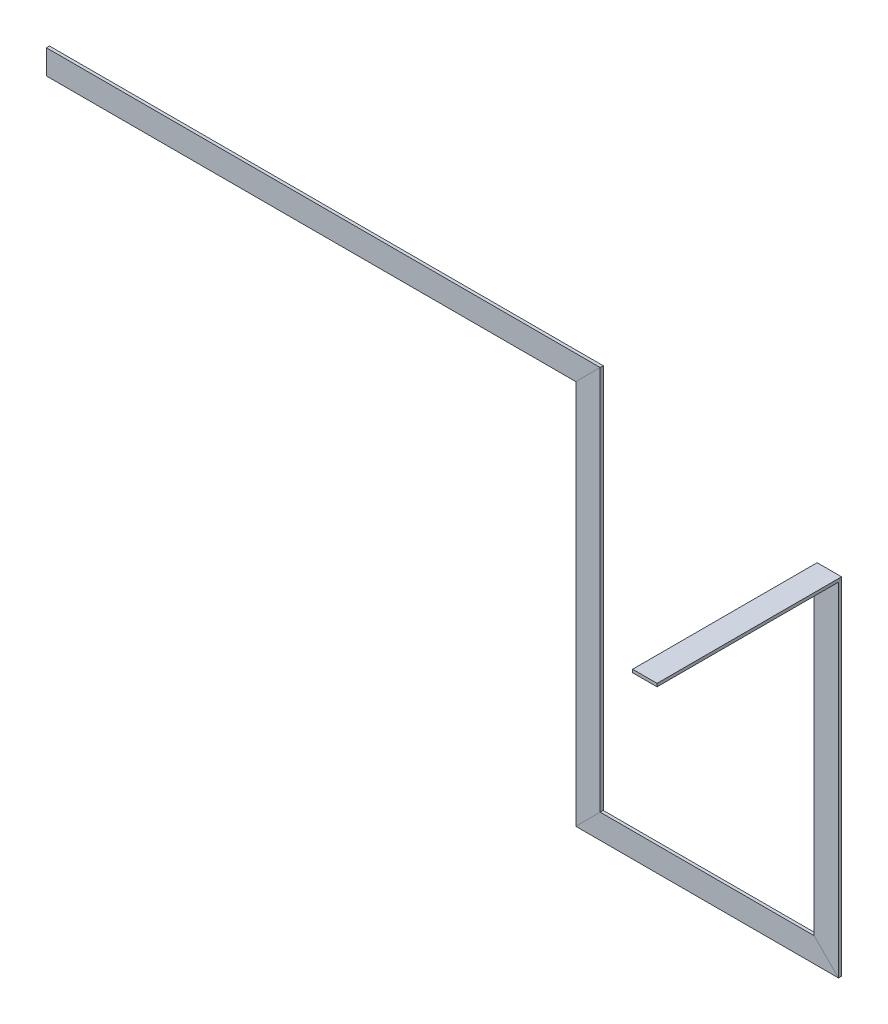
ISO-10303-21;
HEADER;
FILE_DESCRIPTION(('STEP AP214'),'2;1');
FILE_NAME('part.step','',(''),(''),'','','');
FILE_SCHEMA(('AUTOMOTIVE_DESIGN { 1 0 10303 214 1 1 1 1 }'));
ENDSEC;
DATA;
#1=APPLICATION_CONTEXT('core data for automotive mechanical design processes');
#2=APPLICATION_PROTOCOL_DEFINITION('international standard','automotive_design',2000,#1);
#3=PRODUCT_CONTEXT('',#1,'mechanical');
#4=PRODUCT('Part','Part','',(#3));
#5=PRODUCT_RELATED_PRODUCT_CATEGORY('part','',(#4));
#6=PRODUCT_DEFINITION_FORMATION('','',#4);
#7=PRODUCT_DEFINITION_CONTEXT('part definition',#1,'design');
#8=PRODUCT_DEFINITION('design','',#6,#7);
#9=PRODUCT_DEFINITION_SHAPE('','',#8);
#10=(LENGTH_UNIT() NAMED_UNIT(*) SI_UNIT(.MILLI.,.METRE.));
#11=(NAMED_UNIT(*) PLANE_ANGLE_UNIT() SI_UNIT($,.RADIAN.));
#12=(NAMED_UNIT(*) SI_UNIT($,.STERADIAN.) SOLID_ANGLE_UNIT());
#13=UNCERTAINTY_MEASURE_WITH_UNIT(LENGTH_MEASURE(1.E-05),#10,'distance_accuracy_value','');
#14=(GEOMETRIC_REPRESENTATION_CONTEXT(3) GLOBAL_UNCERTAINTY_ASSIGNED_CONTEXT((#13)) GLOBAL_UNIT_ASSIGNED_CONTEXT((#10,
#11,#12)) REPRESENTATION_CONTEXT('',''));
#15=CARTESIAN_POINT('',(0.,0.,0.));
#16=DIRECTION('',(0.,0.,1.));
#17=DIRECTION('',(1.,0.,0.));
#18=AXIS2_PLACEMENT_3D('',#15,#16,#17);
#19=CARTESIAN_POINT('',(735.337545450186,185.501590909091,53.3568181818182));
#20=DIRECTION('',(0.,0.,1.));
#21=DIRECTION('',(1.,0.,0.));
#22=AXIS2_PLACEMENT_3D('',#19,#20,#21);
#23=PLANE('',#22);
#24=DIRECTION('',(0.,-1.,0.));
#25=VECTOR('',#24,1.);
#26=CARTESIAN_POINT('',(735.337545450186,185.501590909091,53.3568181818182));
#27=LINE('',#26,#25);
#28=CARTESIAN_POINT('',(735.337545450186,178.734090909091,53.3568181818182));
#29=VERTEX_POINT('',#28);
#30=CARTESIAN_POINT('',(735.337545450186,-533.490909090909,53.3568181818182));
#31=VERTEX_POINT('',#30);
#32=EDGE_CURVE('E181',#29,#31,#27,.T.);
#33=ORIENTED_EDGE('',*,*,#32,.F.);
#34=DIRECTION('',(1.,0.,0.));
#35=VECTOR('',#34,1.);
#36=CARTESIAN_POINT('',(684.537545450186,178.734090909091,53.3568181818182));
#37=LINE('',#36,#35);
#38=CARTESIAN_POINT('',(684.537545450186,178.734090909091,53.3568181818182));
#39=VERTEX_POINT('',#38);
#40=EDGE_CURVE('E218',#39,#29,#37,.T.);
#41=ORIENTED_EDGE('',*,*,#40,.F.);
#42=DIRECTION('',(0.,-1.,0.));
#43=VECTOR('',#42,1.);
#44=CARTESIAN_POINT('',(684.537545450186,185.501590909091,53.3568181818182));
#45=LINE('',#44,#43);
#46=CARTESIAN_POINT('',(684.537545450186,-482.690909090909,53.3568181818182));
#47=VERTEX_POINT('',#46);
#48=EDGE_CURVE('E186',#39,#47,#45,.T.);
#49=ORIENTED_EDGE('',*,*,#48,.T.);
#50=DIRECTION('',(0.707106781186548,-0.707106781186548,0.));
#51=VECTOR('',#50,1.);
#52=CARTESIAN_POINT('',(375.841295450186,-173.994659090909,53.3568181818182));
#53=LINE('',#52,#51);
#54=EDGE_CURVE('E185',#47,#31,#53,.T.);
#55=ORIENTED_EDGE('',*,*,#54,.T.);
#56=EDGE_LOOP('',(#33,#41,#49,#55));
#57=FACE_BOUND('',#56,.T.);
#58=ADVANCED_FACE('F33',(#57),#23,.T.);
#59=CARTESIAN_POINT('',(-910.052613599814,1001.84471685928,-131.727272727273));
#60=DIRECTION('',(1.,0.,0.));
#61=DIRECTION('',(0.,1.,0.));
#62=AXIS2_PLACEMENT_3D('',#59,#60,#61);
#63=PLANE('',#62);
#64=DIRECTION('',(0.,0.,-1.));
#65=VECTOR('',#64,1.);
#66=CARTESIAN_POINT('',(-910.052613599814,317.307171409091,53.3568181818182));
#67=LINE('',#66,#65);
#68=CARTESIAN_POINT('',(-910.052613599814,317.307171409091,53.3568181818182));
#69=VERTEX_POINT('',#68);
#70=CARTESIAN_POINT('',(-910.052613599814,317.307171409091,47.0068181818182));
#71=VERTEX_POINT('',#70);
#72=EDGE_CURVE('E104',#69,#71,#67,.T.);
#73=ORIENTED_EDGE('',*,*,#72,.T.);
#74=DIRECTION('',(0.,-1.,0.));
#75=VECTOR('',#74,1.);
#76=CARTESIAN_POINT('',(-910.052613599814,266.507171409091,47.0068181818182));
#77=LINE('',#76,#75);
#78=CARTESIAN_POINT('',(-910.052613599814,266.507171409091,47.0068181818182));
#79=VERTEX_POINT('',#78);
#80=EDGE_CURVE('E124',#71,#79,#77,.T.);
#81=ORIENTED_EDGE('',*,*,#80,.T.);
#82=DIRECTION('',(0.,0.,1.));
#83=VECTOR('',#82,1.);
#84=CARTESIAN_POINT('',(-910.052613599814,266.507171409091,53.3568181818182));
#85=LINE('',#84,#83);
#86=CARTESIAN_POINT('',(-910.052613599814,266.507171409091,53.3568181818182));
#87=VERTEX_POINT('',#86);
#88=EDGE_CURVE('E109',#79,#87,#85,.T.);
#89=ORIENTED_EDGE('',*,*,#88,.T.);
#90=DIRECTION('',(0.,1.,0.));
#91=VECTOR('',#90,1.);
#92=CARTESIAN_POINT('',(-910.052613599814,266.507171409091,53.3568181818182));
#93=LINE('',#92,#91);
#94=EDGE_CURVE('E107',#87,#69,#93,.T.);
#95=ORIENTED_EDGE('',*,*,#94,.T.);
#96=EDGE_LOOP('',(#73,#81,#89,#95));
#97=FACE_BOUND('',#96,.T.);
#98=ADVANCED_FACE('F35',(#97),#63,.F.);
#99=CARTESIAN_POINT('',(242.976636360186,317.307171409091,53.3568181818182));
#100=DIRECTION('',(0.,1.,0.));
#101=DIRECTION('',(0.,0.,1.));
#102=AXIS2_PLACEMENT_3D('',#99,#100,#101);
#103=PLANE('',#102);
#104=DIRECTION('',(0.,0.,1.));
#105=VECTOR('',#104,1.);
#106=CARTESIAN_POINT('',(240.336636360186,317.307171409091,53.3568181818182));
#107=LINE('',#106,#105);
#108=CARTESIAN_POINT('',(240.336636360186,317.307171409091,47.0068181818182));
#109=VERTEX_POINT('',#108);
#110=CARTESIAN_POINT('',(240.336636360186,317.307171409091,53.3568181818182));
#111=VERTEX_POINT('',#110);
#112=EDGE_CURVE('E140',#109,#111,#107,.T.);
#113=ORIENTED_EDGE('',*,*,#112,.F.);
#114=DIRECTION('',(-1.,0.,0.));
#115=VECTOR('',#114,1.);
#116=CARTESIAN_POINT('',(242.976636360186,317.307171409091,47.0068181818182));
#117=LINE('',#116,#115);
#118=EDGE_CURVE('E122',#109,#71,#117,.T.);
#119=ORIENTED_EDGE('',*,*,#118,.T.);
#120=ORIENTED_EDGE('',*,*,#72,.F.);
#121=DIRECTION('',(-1.,0.,0.));
#122=VECTOR('',#121,1.);
#123=CARTESIAN_POINT('',(242.976636360186,317.307171409091,53.3568181818182));
#124=LINE('',#123,#122);
#125=EDGE_CURVE('E37',#111,#69,#124,.T.);
#126=ORIENTED_EDGE('',*,*,#125,.F.);
#127=EDGE_LOOP('',(#113,#119,#120,#126));
#128=FACE_BOUND('',#127,.T.);
#129=ADVANCED_FACE('F119',(#128),#103,.T.);
#130=CARTESIAN_POINT('',(242.976636360186,266.507171409091,47.0068181818182));
#131=DIRECTION('',(0.,0.,-1.));
#132=DIRECTION('',(-1.,0.,0.));
#133=AXIS2_PLACEMENT_3D('',#130,#131,#132);
#134=PLANE('',#133);
#135=DIRECTION('',(0.707106781186548,0.707106781186548,0.));
#136=VECTOR('',#135,1.);
#137=CARTESIAN_POINT('',(-211.782403889814,-134.811868840909,47.0068181818182));
#138=LINE('',#137,#136);
#139=CARTESIAN_POINT('',(189.536636360186,266.507171409091,47.0068181818182));
#140=VERTEX_POINT('',#139);
#141=EDGE_CURVE('E154',#140,#109,#138,.T.);
#142=ORIENTED_EDGE('',*,*,#141,.F.);
#143=DIRECTION('',(-1.,0.,0.));
#144=VECTOR('',#143,1.);
#145=CARTESIAN_POINT('',(242.976636360186,266.507171409091,47.0068181818182));
#146=LINE('',#145,#144);
#147=EDGE_CURVE('E133',#140,#79,#146,.T.);
#148=ORIENTED_EDGE('',*,*,#147,.T.);
#149=ORIENTED_EDGE('',*,*,#80,.F.);
#150=ORIENTED_EDGE('',*,*,#118,.F.);
#151=EDGE_LOOP('',(#142,#148,#149,#150));
#152=FACE_BOUND('',#151,.T.);
#153=ADVANCED_FACE('F362',(#152),#134,.T.);
#154=CARTESIAN_POINT('',(242.976636360186,266.507171409091,53.3568181818182));
#155=DIRECTION('',(0.,-1.,0.));
#156=DIRECTION('',(0.,0.,-1.));
#157=AXIS2_PLACEMENT_3D('',#154,#155,#156);
#158=PLANE('',#157);
#159=DIRECTION('',(0.,0.,-1.));
#160=VECTOR('',#159,1.);
#161=CARTESIAN_POINT('',(189.536636360186,266.507171409091,53.3568181818182));
#162=LINE('',#161,#160);
#163=CARTESIAN_POINT('',(189.536636360186,266.507171409091,53.3568181818182));
#164=VERTEX_POINT('',#163);
#165=EDGE_CURVE('E151',#164,#140,#162,.T.);
#166=ORIENTED_EDGE('',*,*,#165,.F.);
#167=DIRECTION('',(-1.,0.,0.));
#168=VECTOR('',#167,1.);
#169=CARTESIAN_POINT('',(242.976636360186,266.507171409091,53.3568181818182));
#170=LINE('',#169,#168);
#171=EDGE_CURVE('E123',#164,#87,#170,.T.);
#172=ORIENTED_EDGE('',*,*,#171,.T.);
#173=ORIENTED_EDGE('',*,*,#88,.F.);
#174=ORIENTED_EDGE('',*,*,#147,.F.);
#175=EDGE_LOOP('',(#166,#172,#173,#174));
#176=FACE_BOUND('',#175,.T.);
#177=ADVANCED_FACE('F365',(#176),#158,.T.);
#178=CARTESIAN_POINT('',(242.976636360186,266.507171409091,53.3568181818182));
#179=DIRECTION('',(0.,0.,1.));
#180=DIRECTION('',(1.,0.,0.));
#181=AXIS2_PLACEMENT_3D('',#178,#179,#180);
#182=PLANE('',#181);
#183=DIRECTION('',(-0.707106781186548,-0.707106781186548,0.));
#184=VECTOR('',#183,1.);
#185=CARTESIAN_POINT('',(-211.782403889814,-134.811868840909,53.3568181818182));
#186=LINE('',#185,#184);
#187=EDGE_CURVE('E128',#111,#164,#186,.T.);
#188=ORIENTED_EDGE('',*,*,#187,.F.);
#189=ORIENTED_EDGE('',*,*,#125,.T.);
#190=ORIENTED_EDGE('',*,*,#94,.F.);
#191=ORIENTED_EDGE('',*,*,#171,.F.);
#192=EDGE_LOOP('',(#188,#189,#190,#191));
#193=FACE_BOUND('',#192,.T.);
#194=ADVANCED_FACE('F126',(#193),#182,.T.);
#195=CARTESIAN_POINT('',(189.536636360186,-536.130909090909,53.3568181818182));
#196=DIRECTION('',(0.,0.,1.));
#197=DIRECTION('',(1.,0.,0.));
#198=AXIS2_PLACEMENT_3D('',#195,#196,#197);
#199=PLANE('',#198);
#200=DIRECTION('',(0.,1.,0.));
#201=VECTOR('',#200,1.);
#202=CARTESIAN_POINT('',(240.336636360186,-536.130909090909,53.3568181818182));
#203=LINE('',#202,#201);
#204=CARTESIAN_POINT('',(240.336636360186,-482.690909090909,53.3568181818182));
#205=VERTEX_POINT('',#204);
#206=EDGE_CURVE('E142',#205,#111,#203,.T.);
#207=ORIENTED_EDGE('',*,*,#206,.T.);
#208=ORIENTED_EDGE('',*,*,#187,.T.);
#209=DIRECTION('',(0.,1.,0.));
#210=VECTOR('',#209,1.);
#211=CARTESIAN_POINT('',(189.536636360186,-536.130909090909,53.3568181818182));
#212=LINE('',#211,#210);
#213=CARTESIAN_POINT('',(189.536636360186,-533.490909090909,53.3568181818182));
#214=VERTEX_POINT('',#213);
#215=EDGE_CURVE('E129',#214,#164,#212,.T.);
#216=ORIENTED_EDGE('',*,*,#215,.F.);
#217=DIRECTION('',(-0.707106781186548,-0.707106781186548,0.));
#218=VECTOR('',#217,1.);
#219=CARTESIAN_POINT('',(463.757090905186,-259.270454545909,53.3568181818182));
#220=LINE('',#219,#218);
#221=EDGE_CURVE('E161',#205,#214,#220,.T.);
#222=ORIENTED_EDGE('',*,*,#221,.F.);
#223=EDGE_LOOP('',(#207,#208,#216,#222));
#224=FACE_BOUND('',#223,.T.);
#225=ADVANCED_FACE('F276',(#224),#199,.T.);
#226=CARTESIAN_POINT('',(189.536636360186,-536.130909090909,53.3568181818182));
#227=DIRECTION('',(-1.,0.,0.));
#228=DIRECTION('',(0.,0.,1.));
#229=AXIS2_PLACEMENT_3D('',#226,#227,#228);
#230=PLANE('',#229);
#231=ORIENTED_EDGE('',*,*,#215,.T.);
#232=ORIENTED_EDGE('',*,*,#165,.T.);
#233=DIRECTION('',(0.,1.,0.));
#234=VECTOR('',#233,1.);
#235=CARTESIAN_POINT('',(189.536636360186,-536.130909090909,47.0068181818182));
#236=LINE('',#235,#234);
#237=CARTESIAN_POINT('',(189.536636360186,-533.490909090909,47.0068181818182));
#238=VERTEX_POINT('',#237);
#239=EDGE_CURVE('E131',#238,#140,#236,.T.);
#240=ORIENTED_EDGE('',*,*,#239,.F.);
#241=DIRECTION('',(0.,0.,-1.));
#242=VECTOR('',#241,1.);
#243=CARTESIAN_POINT('',(189.536636360186,-533.490909090909,53.3568181818182));
#244=LINE('',#243,#242);
#245=EDGE_CURVE('E175',#214,#238,#244,.T.);
#246=ORIENTED_EDGE('',*,*,#245,.F.);
#247=EDGE_LOOP('',(#231,#232,#240,#246));
#248=FACE_BOUND('',#247,.T.);
#249=ADVANCED_FACE('F274',(#248),#230,.T.);
#250=CARTESIAN_POINT('',(189.536636360186,-536.130909090909,47.0068181818182));
#251=DIRECTION('',(0.,0.,-1.));
#252=DIRECTION('',(-1.,0.,0.));
#253=AXIS2_PLACEMENT_3D('',#250,#251,#252);
#254=PLANE('',#253);
#255=ORIENTED_EDGE('',*,*,#239,.T.);
#256=ORIENTED_EDGE('',*,*,#141,.T.);
#257=DIRECTION('',(0.,1.,0.));
#258=VECTOR('',#257,1.);
#259=CARTESIAN_POINT('',(240.336636360186,-536.130909090909,47.0068181818182));
#260=LINE('',#259,#258);
#261=CARTESIAN_POINT('',(240.336636360186,-482.690909090909,47.0068181818182));
#262=VERTEX_POINT('',#261);
#263=EDGE_CURVE('E145',#262,#109,#260,.T.);
#264=ORIENTED_EDGE('',*,*,#263,.F.);
#265=DIRECTION('',(0.707106781186548,0.707106781186548,0.));
#266=VECTOR('',#265,1.);
#267=CARTESIAN_POINT('',(463.757090905186,-259.270454545909,47.0068181818182));
#268=LINE('',#267,#266);
#269=EDGE_CURVE('E178',#238,#262,#268,.T.);
#270=ORIENTED_EDGE('',*,*,#269,.F.);
#271=EDGE_LOOP('',(#255,#256,#264,#270));
#272=FACE_BOUND('',#271,.T.);
#273=ADVANCED_FACE('F351',(#272),#254,.T.);
#274=CARTESIAN_POINT('',(240.336636360186,-536.130909090909,53.3568181818182));
#275=DIRECTION('',(1.,0.,0.));
#276=DIRECTION('',(0.,0.,-1.));
#277=AXIS2_PLACEMENT_3D('',#274,#275,#276);
#278=PLANE('',#277);
#279=ORIENTED_EDGE('',*,*,#263,.T.);
#280=ORIENTED_EDGE('',*,*,#112,.T.);
#281=ORIENTED_EDGE('',*,*,#206,.F.);
#282=DIRECTION('',(0.,0.,1.));
#283=VECTOR('',#282,1.);
#284=CARTESIAN_POINT('',(240.336636360186,-482.690909090909,53.3568181818182));
#285=LINE('',#284,#283);
#286=EDGE_CURVE('E158',#262,#205,#285,.T.);
#287=ORIENTED_EDGE('',*,*,#286,.F.);
#288=EDGE_LOOP('',(#279,#280,#281,#287));
#289=FACE_BOUND('',#288,.T.);
#290=ADVANCED_FACE('F348',(#289),#278,.T.);
#291=CARTESIAN_POINT('',(737.977545450186,-533.490909090909,53.3568181818182));
#292=DIRECTION('',(0.,0.,1.));
#293=DIRECTION('',(1.,0.,0.));
#294=AXIS2_PLACEMENT_3D('',#291,#292,#293);
#295=PLANE('',#294);
#296=DIRECTION('',(-1.,0.,0.));
#297=VECTOR('',#296,1.);
#298=CARTESIAN_POINT('',(737.977545450186,-482.690909090909,53.3568181818182));
#299=LINE('',#298,#297);
#300=EDGE_CURVE('E162',#47,#205,#299,.T.);
#301=ORIENTED_EDGE('',*,*,#300,.T.);
#302=ORIENTED_EDGE('',*,*,#221,.T.);
#303=DIRECTION('',(-1.,0.,0.));
#304=VECTOR('',#303,1.);
#305=CARTESIAN_POINT('',(737.977545450186,-533.490909090909,53.3568181818182));
#306=LINE('',#305,#304);
#307=EDGE_CURVE('E157',#31,#214,#306,.T.);
#308=ORIENTED_EDGE('',*,*,#307,.F.);
#309=ORIENTED_EDGE('',*,*,#54,.F.);
#310=EDGE_LOOP('',(#301,#302,#308,#309));
#311=FACE_BOUND('',#310,.T.);
#312=ADVANCED_FACE('F279',(#311),#295,.T.);
#313=CARTESIAN_POINT('',(737.977545450186,-533.490909090909,53.3568181818182));
#314=DIRECTION('',(0.,-1.,0.));
#315=DIRECTION('',(0.,0.,-1.));
#316=AXIS2_PLACEMENT_3D('',#313,#314,#315);
#317=PLANE('',#316);
#318=ORIENTED_EDGE('',*,*,#307,.T.);
#319=ORIENTED_EDGE('',*,*,#245,.T.);
#320=DIRECTION('',(-1.,0.,0.));
#321=VECTOR('',#320,1.);
#322=CARTESIAN_POINT('',(737.977545450186,-533.490909090909,47.0068181818182));
#323=LINE('',#322,#321);
#324=CARTESIAN_POINT('',(735.337545450186,-533.490909090909,47.0068181818182));
#325=VERTEX_POINT('',#324);
#326=EDGE_CURVE('E168',#325,#238,#323,.T.);
#327=ORIENTED_EDGE('',*,*,#326,.F.);
#328=DIRECTION('',(0.,0.,-1.));
#329=VECTOR('',#328,1.);
#330=CARTESIAN_POINT('',(735.337545450186,-533.490909090909,53.3568181818182));
#331=LINE('',#330,#329);
#332=EDGE_CURVE('E195',#31,#325,#331,.T.);
#333=ORIENTED_EDGE('',*,*,#332,.F.);
#334=EDGE_LOOP('',(#318,#319,#327,#333));
#335=FACE_BOUND('',#334,.T.);
#336=ADVANCED_FACE('F269',(#335),#317,.T.);
#337=CARTESIAN_POINT('',(737.977545450186,-533.490909090909,47.0068181818182));
#338=DIRECTION('',(0.,0.,-1.));
#339=DIRECTION('',(-1.,0.,0.));
#340=AXIS2_PLACEMENT_3D('',#337,#338,#339);
#341=PLANE('',#340);
#342=ORIENTED_EDGE('',*,*,#326,.T.);
#343=ORIENTED_EDGE('',*,*,#269,.T.);
#344=DIRECTION('',(-1.,0.,0.));
#345=VECTOR('',#344,1.);
#346=CARTESIAN_POINT('',(737.977545450186,-482.690909090909,47.0068181818182));
#347=LINE('',#346,#345);
#348=CARTESIAN_POINT('',(684.537545450186,-482.690909090909,47.0068181818182));
#349=VERTEX_POINT('',#348);
#350=EDGE_CURVE('E165',#349,#262,#347,.T.);
#351=ORIENTED_EDGE('',*,*,#350,.F.);
#352=DIRECTION('',(-0.707106781186548,0.707106781186548,0.));
#353=VECTOR('',#352,1.);
#354=CARTESIAN_POINT('',(375.841295450186,-173.994659090909,47.0068181818182));
#355=LINE('',#354,#353);
#356=EDGE_CURVE('E198',#325,#349,#355,.T.);
#357=ORIENTED_EDGE('',*,*,#356,.F.);
#358=EDGE_LOOP('',(#342,#343,#351,#357));
#359=FACE_BOUND('',#358,.T.);
#360=ADVANCED_FACE('F267',(#359),#341,.T.);
#361=CARTESIAN_POINT('',(737.977545450186,-482.690909090909,53.3568181818182));
#362=DIRECTION('',(0.,1.,0.));
#363=DIRECTION('',(0.,0.,1.));
#364=AXIS2_PLACEMENT_3D('',#361,#362,#363);
#365=PLANE('',#364);
#366=ORIENTED_EDGE('',*,*,#350,.T.);
#367=ORIENTED_EDGE('',*,*,#286,.T.);
#368=ORIENTED_EDGE('',*,*,#300,.F.);
#369=DIRECTION('',(0.,0.,1.));
#370=VECTOR('',#369,1.);
#371=CARTESIAN_POINT('',(684.537545450186,-482.690909090909,53.3568181818182));
#372=LINE('',#371,#370);
#373=EDGE_CURVE('E182',#349,#47,#372,.T.);
#374=ORIENTED_EDGE('',*,*,#373,.F.);
#375=EDGE_LOOP('',(#366,#367,#368,#374));
#376=FACE_BOUND('',#375,.T.);
#377=ADVANCED_FACE('F284',(#376),#365,.T.);
#378=CARTESIAN_POINT('',(735.337545450186,185.501590909091,53.3568181818182));
#379=DIRECTION('',(1.,0.,0.));
#380=DIRECTION('',(0.,0.,-1.));
#381=AXIS2_PLACEMENT_3D('',#378,#379,#380);
#382=PLANE('',#381);
#383=DIRECTION('',(0.,-0.707106781186548,-0.707106781186548));
#384=VECTOR('',#383,1.);
#385=CARTESIAN_POINT('',(735.337545450186,158.405681818182,26.6784090909091));
#386=LINE('',#385,#384);
#387=CARTESIAN_POINT('',(735.337545450186,185.084090909091,53.3568181818182));
#388=VERTEX_POINT('',#387);
#389=CARTESIAN_POINT('',(735.337545450186,178.734090909091,47.0068181818182));
#390=VERTEX_POINT('',#389);
#391=EDGE_CURVE('E11',#388,#390,#386,.T.);
#392=ORIENTED_EDGE('',*,*,#391,.F.);
#393=DIRECTION('',(0.,0.,-1.));
#394=VECTOR('',#393,1.);
#395=CARTESIAN_POINT('',(735.337545450186,185.084090909091,430.356818181818));
#396=LINE('',#395,#394);
#397=CARTESIAN_POINT('',(735.337545450186,185.084090909091,430.356818181818));
#398=VERTEX_POINT('',#397);
#399=EDGE_CURVE('E215',#398,#388,#396,.T.);
#400=ORIENTED_EDGE('',*,*,#399,.F.);
#401=DIRECTION('',(0.,1.,0.));
#402=VECTOR('',#401,1.);
#403=CARTESIAN_POINT('',(735.337545450186,178.734090909091,430.356818181818));
#404=LINE('',#403,#402);
#405=CARTESIAN_POINT('',(735.337545450186,178.734090909091,430.356818181818));
#406=VERTEX_POINT('',#405);
#407=EDGE_CURVE('E217',#406,#398,#404,.T.);
#408=ORIENTED_EDGE('',*,*,#407,.F.);
#409=DIRECTION('',(0.,0.,-1.));
#410=VECTOR('',#409,1.);
#411=CARTESIAN_POINT('',(735.337545450186,178.734090909091,430.356818181818));
#412=LINE('',#411,#410);
#413=EDGE_CURVE('E212',#406,#29,#412,.T.);
#414=ORIENTED_EDGE('',*,*,#413,.T.);
#415=ORIENTED_EDGE('',*,*,#32,.T.);
#416=ORIENTED_EDGE('',*,*,#332,.T.);
#417=DIRECTION('',(0.,-1.,0.));
#418=VECTOR('',#417,1.);
#419=CARTESIAN_POINT('',(735.337545450186,185.501590909091,47.0068181818182));
#420=LINE('',#419,#418);
#421=EDGE_CURVE('E190',#390,#325,#420,.T.);
#422=ORIENTED_EDGE('',*,*,#421,.F.);
#423=EDGE_LOOP('',(#392,#400,#408,#414,#415,#416,#422));
#424=FACE_BOUND('',#423,.T.);
#425=ADVANCED_FACE('F259',(#424),#382,.T.);
#426=CARTESIAN_POINT('',(735.337545450186,185.501590909091,47.0068181818182));
#427=DIRECTION('',(0.,0.,-1.));
#428=DIRECTION('',(-1.,0.,0.));
#429=AXIS2_PLACEMENT_3D('',#426,#427,#428);
#430=PLANE('',#429);
#431=ORIENTED_EDGE('',*,*,#356,.T.);
#432=DIRECTION('',(0.,-1.,0.));
#433=VECTOR('',#432,1.);
#434=CARTESIAN_POINT('',(684.537545450186,185.501590909091,47.0068181818182));
#435=LINE('',#434,#433);
#436=CARTESIAN_POINT('',(684.537545450186,178.734090909091,47.0068181818182));
#437=VERTEX_POINT('',#436);
#438=EDGE_CURVE('E188',#437,#349,#435,.T.);
#439=ORIENTED_EDGE('',*,*,#438,.F.);
#440=DIRECTION('',(0.,1.,0.));
#441=VECTOR('',#440,1.);
#442=CARTESIAN_POINT('',(684.537545450186,156.084090909091,47.0068181818182));
#443=LINE('',#442,#441);
#444=CARTESIAN_POINT('',(684.537545450186,185.084090909091,47.0068181818182));
#445=VERTEX_POINT('',#444);
#446=EDGE_CURVE('E233',#437,#445,#443,.T.);
#447=ORIENTED_EDGE('',*,*,#446,.T.);
#448=DIRECTION('',(1.,0.,0.));
#449=VECTOR('',#448,1.);
#450=CARTESIAN_POINT('',(735.337545450186,185.084090909091,47.0068181818182));
#451=LINE('',#450,#449);
#452=CARTESIAN_POINT('',(735.337545450186,185.084090909091,47.0068181818182));
#453=VERTEX_POINT('',#452);
#454=EDGE_CURVE('E236',#445,#453,#451,.T.);
#455=ORIENTED_EDGE('',*,*,#454,.T.);
#456=DIRECTION('',(0.,1.,0.));
#457=VECTOR('',#456,1.);
#458=CARTESIAN_POINT('',(735.337545450186,156.084090909091,47.0068181818182));
#459=LINE('',#458,#457);
#460=EDGE_CURVE('E222',#390,#453,#459,.T.);
#461=ORIENTED_EDGE('',*,*,#460,.F.);
#462=ORIENTED_EDGE('',*,*,#421,.T.);
#463=EDGE_LOOP('',(#431,#439,#447,#455,#461,#462));
#464=FACE_BOUND('',#463,.T.);
#465=ADVANCED_FACE('F243',(#464),#430,.T.);
#466=CARTESIAN_POINT('',(684.537545450186,185.501590909091,53.3568181818182));
#467=DIRECTION('',(-1.,0.,0.));
#468=DIRECTION('',(0.,0.,1.));
#469=AXIS2_PLACEMENT_3D('',#466,#467,#468);
#470=PLANE('',#469);
#471=ORIENTED_EDGE('',*,*,#438,.T.);
#472=ORIENTED_EDGE('',*,*,#373,.T.);
#473=ORIENTED_EDGE('',*,*,#48,.F.);
#474=DIRECTION('',(0.,0.,-1.));
#475=VECTOR('',#474,1.);
#476=CARTESIAN_POINT('',(684.537545450186,178.734090909091,430.356818181818));
#477=LINE('',#476,#475);
#478=CARTESIAN_POINT('',(684.537545450186,178.734090909091,430.356818181818));
#479=VERTEX_POINT('',#478);
#480=EDGE_CURVE('E209',#479,#39,#477,.T.);
#481=ORIENTED_EDGE('',*,*,#480,.F.);
#482=DIRECTION('',(0.,-1.,0.));
#483=VECTOR('',#482,1.);
#484=CARTESIAN_POINT('',(684.537545450186,185.084090909091,430.356818181818));
#485=LINE('',#484,#483);
#486=CARTESIAN_POINT('',(684.537545450186,185.084090909091,430.356818181818));
#487=VERTEX_POINT('',#486);
#488=EDGE_CURVE('E228',#487,#479,#485,.T.);
#489=ORIENTED_EDGE('',*,*,#488,.F.);
#490=DIRECTION('',(0.,0.,-1.));
#491=VECTOR('',#490,1.);
#492=CARTESIAN_POINT('',(684.537545450186,185.084090909091,430.356818181818));
#493=LINE('',#492,#491);
#494=CARTESIAN_POINT('',(684.537545450186,185.084090909091,53.3568181818182));
#495=VERTEX_POINT('',#494);
#496=EDGE_CURVE('E114',#487,#495,#493,.T.);
#497=ORIENTED_EDGE('',*,*,#496,.T.);
#498=DIRECTION('',(0.,0.707106781186548,0.707106781186548));
#499=VECTOR('',#498,1.);
#500=CARTESIAN_POINT('',(684.537545450186,158.405681818182,26.6784090909091));
#501=LINE('',#500,#499);
#502=EDGE_CURVE('E43',#437,#495,#501,.T.);
#503=ORIENTED_EDGE('',*,*,#502,.F.);
#504=EDGE_LOOP('',(#471,#472,#473,#481,#489,#497,#503));
#505=FACE_BOUND('',#504,.T.);
#506=ADVANCED_FACE('F287',(#505),#470,.T.);
#507=CARTESIAN_POINT('',(735.337545450186,185.084090909091,0.));
#508=DIRECTION('',(0.,1.,0.));
#509=DIRECTION('',(0.,0.,1.));
#510=AXIS2_PLACEMENT_3D('',#507,#508,#509);
#511=PLANE('',#510);
#512=ORIENTED_EDGE('',*,*,#454,.F.);
#513=DIRECTION('',(0.,0.,1.));
#514=VECTOR('',#513,1.);
#515=CARTESIAN_POINT('',(684.537545450186,185.084090909091,0.));
#516=LINE('',#515,#514);
#517=EDGE_CURVE('E201',#445,#495,#516,.T.);
#518=ORIENTED_EDGE('',*,*,#517,.T.);
#519=ORIENTED_EDGE('',*,*,#496,.F.);
#520=DIRECTION('',(-1.,0.,0.));
#521=VECTOR('',#520,1.);
#522=CARTESIAN_POINT('',(735.337545450186,185.084090909091,430.356818181818));
#523=LINE('',#522,#521);
#524=EDGE_CURVE('E221',#398,#487,#523,.T.);
#525=ORIENTED_EDGE('',*,*,#524,.F.);
#526=ORIENTED_EDGE('',*,*,#399,.T.);
#527=DIRECTION('',(0.,0.,1.));
#528=VECTOR('',#527,1.);
#529=CARTESIAN_POINT('',(735.337545450186,185.084090909091,0.));
#530=LINE('',#529,#528);
#531=EDGE_CURVE('E51',#453,#388,#530,.T.);
#532=ORIENTED_EDGE('',*,*,#531,.F.);
#533=EDGE_LOOP('',(#512,#518,#519,#525,#526,#532));
#534=FACE_BOUND('',#533,.T.);
#535=ADVANCED_FACE('F253',(#534),#511,.T.);
#536=CARTESIAN_POINT('',(735.337545450186,185.084090909091,0.));
#537=DIRECTION('',(1.,0.,0.));
#538=DIRECTION('',(0.,0.,-1.));
#539=AXIS2_PLACEMENT_3D('',#536,#537,#538);
#540=PLANE('',#539);
#541=ORIENTED_EDGE('',*,*,#460,.T.);
#542=ORIENTED_EDGE('',*,*,#531,.T.);
#543=ORIENTED_EDGE('',*,*,#391,.T.);
#544=EDGE_LOOP('',(#541,#542,#543));
#545=FACE_BOUND('',#544,.T.);
#546=ADVANCED_FACE('F251',(#545),#540,.T.);
#547=CARTESIAN_POINT('',(684.537545450186,185.084090909091,0.));
#548=DIRECTION('',(-1.,0.,0.));
#549=DIRECTION('',(0.,0.,1.));
#550=AXIS2_PLACEMENT_3D('',#547,#548,#549);
#551=PLANE('',#550);
#552=ORIENTED_EDGE('',*,*,#446,.F.);
#553=ORIENTED_EDGE('',*,*,#502,.T.);
#554=ORIENTED_EDGE('',*,*,#517,.F.);
#555=EDGE_LOOP('',(#552,#553,#554));
#556=FACE_BOUND('',#555,.T.);
#557=ADVANCED_FACE('F293',(#556),#551,.T.);
#558=CARTESIAN_POINT('',(684.537545450186,178.734090909091,430.356818181818));
#559=DIRECTION('',(0.,1.,0.));
#560=DIRECTION('',(0.,0.,1.));
#561=AXIS2_PLACEMENT_3D('',#558,#559,#560);
#562=PLANE('',#561);
#563=ORIENTED_EDGE('',*,*,#40,.T.);
#564=ORIENTED_EDGE('',*,*,#413,.F.);
#565=DIRECTION('',(1.,0.,0.));
#566=VECTOR('',#565,1.);
#567=CARTESIAN_POINT('',(684.537545450186,178.734090909091,430.356818181818));
#568=LINE('',#567,#566);
#569=EDGE_CURVE('E225',#479,#406,#568,.T.);
#570=ORIENTED_EDGE('',*,*,#569,.F.);
#571=ORIENTED_EDGE('',*,*,#480,.T.);
#572=EDGE_LOOP('',(#563,#564,#570,#571));
#573=FACE_BOUND('',#572,.T.);
#574=ADVANCED_FACE('F317',(#573),#562,.F.);
#575=CARTESIAN_POINT('',(0.,0.,430.356818181818));
#576=DIRECTION('',(0.,0.,1.));
#577=DIRECTION('',(1.,0.,0.));
#578=AXIS2_PLACEMENT_3D('',#575,#576,#577);
#579=PLANE('',#578);
#580=ORIENTED_EDGE('',*,*,#524,.T.);
#581=ORIENTED_EDGE('',*,*,#488,.T.);
#582=ORIENTED_EDGE('',*,*,#569,.T.);
#583=ORIENTED_EDGE('',*,*,#407,.T.);
#584=EDGE_LOOP('',(#580,#581,#582,#583));
#585=FACE_BOUND('',#584,.T.);
#586=ADVANCED_FACE('F309',(#585),#579,.T.);
#587=CLOSED_SHELL('',(#58,#98,#129,#153,#177,#194,#225,#249,#273,#290,#312,#336,#360,#377,#425,
#465,#506,#535,#546,#557,#574,#586));
#588=MANIFOLD_SOLID_BREP('B2',#587);
#589=ADVANCED_BREP_SHAPE_REPRESENTATION('',(#18,#588),#14);
#590=SHAPE_DEFINITION_REPRESENTATION(#9,#589);
ENDSEC;
END-ISO-10303-21;
